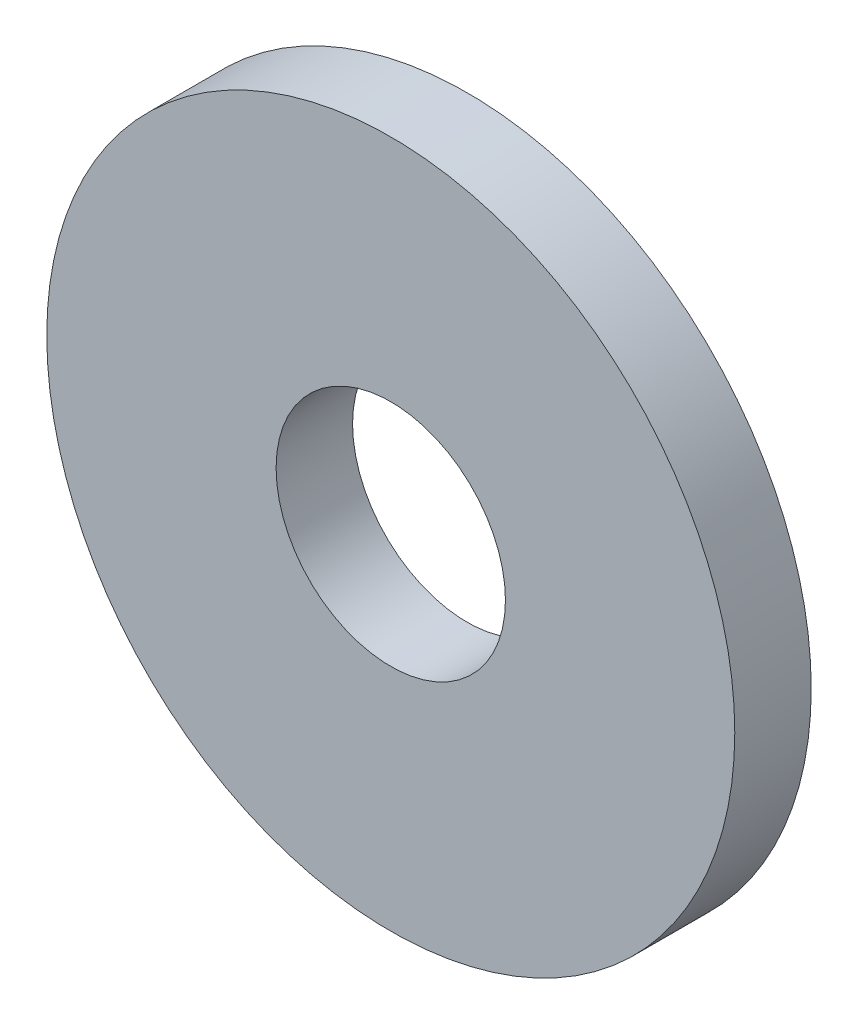
ISO-10303-21;
HEADER;
FILE_DESCRIPTION(('STEP AP214'),'2;1');
FILE_NAME('part.step','',(''),(''),'','','');
FILE_SCHEMA(('AUTOMOTIVE_DESIGN { 1 0 10303 214 1 1 1 1 }'));
ENDSEC;
DATA;
#1=APPLICATION_CONTEXT('core data for automotive mechanical design processes');
#2=APPLICATION_PROTOCOL_DEFINITION('international standard','automotive_design',2000,#1);
#3=PRODUCT_CONTEXT('',#1,'mechanical');
#4=PRODUCT('Part','Part','',(#3));
#5=PRODUCT_RELATED_PRODUCT_CATEGORY('part','',(#4));
#6=PRODUCT_DEFINITION_FORMATION('','',#4);
#7=PRODUCT_DEFINITION_CONTEXT('part definition',#1,'design');
#8=PRODUCT_DEFINITION('design','',#6,#7);
#9=PRODUCT_DEFINITION_SHAPE('','',#8);
#10=(LENGTH_UNIT() NAMED_UNIT(*) SI_UNIT(.MILLI.,.METRE.));
#11=(NAMED_UNIT(*) PLANE_ANGLE_UNIT() SI_UNIT($,.RADIAN.));
#12=(NAMED_UNIT(*) SI_UNIT($,.STERADIAN.) SOLID_ANGLE_UNIT());
#13=UNCERTAINTY_MEASURE_WITH_UNIT(LENGTH_MEASURE(1.E-05),#10,'distance_accuracy_value','');
#14=(GEOMETRIC_REPRESENTATION_CONTEXT(3) GLOBAL_UNCERTAINTY_ASSIGNED_CONTEXT((#13)) GLOBAL_UNIT_ASSIGNED_CONTEXT((#10,
#11,#12)) REPRESENTATION_CONTEXT('',''));
#15=CARTESIAN_POINT('',(0.,0.,0.));
#16=DIRECTION('',(0.,0.,1.));
#17=DIRECTION('',(1.,0.,0.));
#18=AXIS2_PLACEMENT_3D('',#15,#16,#17);
#19=CARTESIAN_POINT('',(0.,0.,1.));
#20=DIRECTION('',(0.,0.,1.));
#21=DIRECTION('',(1.,0.,0.));
#22=AXIS2_PLACEMENT_3D('',#19,#20,#21);
#23=PLANE('',#22);
#24=CARTESIAN_POINT('',(0.,0.,1.));
#25=DIRECTION('',(0.,0.,1.));
#26=DIRECTION('',(1.,0.,0.));
#27=AXIS2_PLACEMENT_3D('',#24,#25,#26);
#28=CIRCLE('',#27,4.5);
#29=CARTESIAN_POINT('',(4.5,0.,1.));
#30=VERTEX_POINT('',#29);
#31=EDGE_CURVE('E10',#30,#30,#28,.T.);
#32=ORIENTED_EDGE('',*,*,#31,.T.);
#33=EDGE_LOOP('',(#32));
#34=FACE_BOUND('',#33,.T.);
#35=CARTESIAN_POINT('',(0.,0.,1.));
#36=DIRECTION('',(0.,0.,1.));
#37=DIRECTION('',(1.,0.,0.));
#38=AXIS2_PLACEMENT_3D('',#35,#36,#37);
#39=CIRCLE('',#38,1.5);
#40=CARTESIAN_POINT('',(1.5,0.,1.));
#41=VERTEX_POINT('',#40);
#42=EDGE_CURVE('E44',#41,#41,#39,.T.);
#43=ORIENTED_EDGE('',*,*,#42,.F.);
#44=EDGE_LOOP('',(#43));
#45=FACE_BOUND('',#44,.T.);
#46=ADVANCED_FACE('F33',(#34,#45),#23,.T.);
#47=CARTESIAN_POINT('',(0.,0.,0.));
#48=DIRECTION('',(0.,0.,1.));
#49=DIRECTION('',(1.,0.,0.));
#50=AXIS2_PLACEMENT_3D('',#47,#48,#49);
#51=PLANE('',#50);
#52=CARTESIAN_POINT('',(0.,0.,0.));
#53=DIRECTION('',(0.,0.,1.));
#54=DIRECTION('',(1.,0.,0.));
#55=AXIS2_PLACEMENT_3D('',#52,#53,#54);
#56=CIRCLE('',#55,4.5);
#57=CARTESIAN_POINT('',(4.5,0.,0.));
#58=VERTEX_POINT('',#57);
#59=EDGE_CURVE('E37',#58,#58,#56,.T.);
#60=ORIENTED_EDGE('',*,*,#59,.F.);
#61=EDGE_LOOP('',(#60));
#62=FACE_BOUND('',#61,.T.);
#63=CARTESIAN_POINT('',(0.,0.,0.));
#64=DIRECTION('',(0.,0.,1.));
#65=DIRECTION('',(1.,0.,0.));
#66=AXIS2_PLACEMENT_3D('',#63,#64,#65);
#67=CIRCLE('',#66,1.5);
#68=CARTESIAN_POINT('',(1.5,0.,0.));
#69=VERTEX_POINT('',#68);
#70=EDGE_CURVE('E46',#69,#69,#67,.T.);
#71=ORIENTED_EDGE('',*,*,#70,.T.);
#72=EDGE_LOOP('',(#71));
#73=FACE_BOUND('',#72,.T.);
#74=ADVANCED_FACE('F56',(#62,#73),#51,.F.);
#75=CARTESIAN_POINT('',(0.,0.,1.));
#76=DIRECTION('',(0.,0.,-1.));
#77=DIRECTION('',(-1.,0.,0.));
#78=AXIS2_PLACEMENT_3D('',#75,#76,#77);
#79=CYLINDRICAL_SURFACE('',#78,4.5);
#80=ORIENTED_EDGE('',*,*,#31,.F.);
#81=EDGE_LOOP('',(#80));
#82=FACE_BOUND('',#81,.T.);
#83=ORIENTED_EDGE('',*,*,#59,.T.);
#84=EDGE_LOOP('',(#83));
#85=FACE_BOUND('',#84,.T.);
#86=ADVANCED_FACE('F35',(#82,#85),#79,.T.);
#87=CARTESIAN_POINT('',(0.,0.,1.));
#88=DIRECTION('',(0.,0.,-1.));
#89=DIRECTION('',(-1.,0.,0.));
#90=AXIS2_PLACEMENT_3D('',#87,#88,#89);
#91=CYLINDRICAL_SURFACE('',#90,1.5);
#92=ORIENTED_EDGE('',*,*,#42,.T.);
#93=EDGE_LOOP('',(#92));
#94=FACE_BOUND('',#93,.T.);
#95=ORIENTED_EDGE('',*,*,#70,.F.);
#96=EDGE_LOOP('',(#95));
#97=FACE_BOUND('',#96,.T.);
#98=ADVANCED_FACE('F52',(#94,#97),#91,.F.);
#99=CLOSED_SHELL('',(#46,#74,#86,#98));
#100=MANIFOLD_SOLID_BREP('B2',#99);
#101=ADVANCED_BREP_SHAPE_REPRESENTATION('',(#18,#100),#14);
#102=SHAPE_DEFINITION_REPRESENTATION(#9,#101);
ENDSEC;
END-ISO-10303-21;
